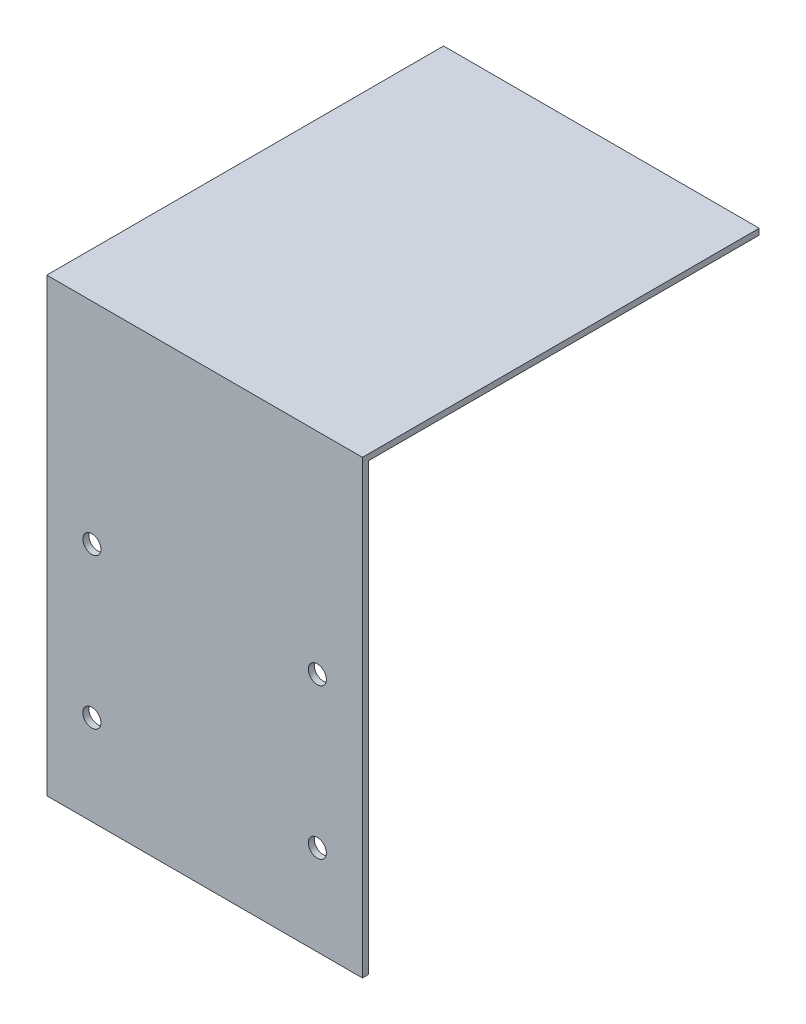
ISO-10303-21;
HEADER;
FILE_DESCRIPTION(('STEP AP214'),'2;1');
FILE_NAME('part.step','',(''),(''),'','','');
FILE_SCHEMA(('AUTOMOTIVE_DESIGN { 1 0 10303 214 1 1 1 1 }'));
ENDSEC;
DATA;
#1=APPLICATION_CONTEXT('core data for automotive mechanical design processes');
#2=APPLICATION_PROTOCOL_DEFINITION('international standard','automotive_design',2000,#1);
#3=PRODUCT_CONTEXT('',#1,'mechanical');
#4=PRODUCT('Part','Part','',(#3));
#5=PRODUCT_RELATED_PRODUCT_CATEGORY('part','',(#4));
#6=PRODUCT_DEFINITION_FORMATION('','',#4);
#7=PRODUCT_DEFINITION_CONTEXT('part definition',#1,'design');
#8=PRODUCT_DEFINITION('design','',#6,#7);
#9=PRODUCT_DEFINITION_SHAPE('','',#8);
#10=(LENGTH_UNIT() NAMED_UNIT(*) SI_UNIT(.MILLI.,.METRE.));
#11=(NAMED_UNIT(*) PLANE_ANGLE_UNIT() SI_UNIT($,.RADIAN.));
#12=(NAMED_UNIT(*) SI_UNIT($,.STERADIAN.) SOLID_ANGLE_UNIT());
#13=UNCERTAINTY_MEASURE_WITH_UNIT(LENGTH_MEASURE(1.E-05),#10,'distance_accuracy_value','');
#14=(GEOMETRIC_REPRESENTATION_CONTEXT(3) GLOBAL_UNCERTAINTY_ASSIGNED_CONTEXT((#13)) GLOBAL_UNIT_ASSIGNED_CONTEXT((#10,
#11,#12)) REPRESENTATION_CONTEXT('',''));
#15=CARTESIAN_POINT('',(0.,0.,0.));
#16=DIRECTION('',(0.,0.,1.));
#17=DIRECTION('',(1.,0.,0.));
#18=AXIS2_PLACEMENT_3D('',#15,#16,#17);
#19=CARTESIAN_POINT('',(105.,150.,2.));
#20=DIRECTION('',(0.,-1.,0.));
#21=DIRECTION('',(0.,0.,-1.));
#22=AXIS2_PLACEMENT_3D('',#19,#20,#21);
#23=PLANE('',#22);
#24=DIRECTION('',(0.,0.,-1.));
#25=VECTOR('',#24,1.);
#26=CARTESIAN_POINT('',(105.,150.,2.));
#27=LINE('',#26,#25);
#28=CARTESIAN_POINT('',(105.,150.,2.));
#29=VERTEX_POINT('',#28);
#30=CARTESIAN_POINT('',(105.,150.,-130.));
#31=VERTEX_POINT('',#30);
#32=EDGE_CURVE('E165',#29,#31,#27,.T.);
#33=ORIENTED_EDGE('',*,*,#32,.T.);
#34=DIRECTION('',(1.,0.,0.));
#35=VECTOR('',#34,1.);
#36=CARTESIAN_POINT('',(105.,150.,-130.));
#37=LINE('',#36,#35);
#38=CARTESIAN_POINT('',(0.,150.,-130.));
#39=VERTEX_POINT('',#38);
#40=EDGE_CURVE('E112',#39,#31,#37,.T.);
#41=ORIENTED_EDGE('',*,*,#40,.F.);
#42=DIRECTION('',(0.,0.,-1.));
#43=VECTOR('',#42,1.);
#44=CARTESIAN_POINT('',(0.,150.,2.));
#45=LINE('',#44,#43);
#46=CARTESIAN_POINT('',(0.,150.,2.));
#47=VERTEX_POINT('',#46);
#48=EDGE_CURVE('E11',#47,#39,#45,.T.);
#49=ORIENTED_EDGE('',*,*,#48,.F.);
#50=DIRECTION('',(-1.,0.,0.));
#51=VECTOR('',#50,1.);
#52=CARTESIAN_POINT('',(105.,150.,2.));
#53=LINE('',#52,#51);
#54=EDGE_CURVE('E77',#29,#47,#53,.T.);
#55=ORIENTED_EDGE('',*,*,#54,.F.);
#56=EDGE_LOOP('',(#33,#41,#49,#55));
#57=FACE_BOUND('',#56,.T.);
#58=ADVANCED_FACE('F32',(#57),#23,.F.);
#59=CARTESIAN_POINT('',(0.,0.,2.));
#60=DIRECTION('',(-1.,0.,0.));
#61=DIRECTION('',(0.,0.,1.));
#62=AXIS2_PLACEMENT_3D('',#59,#60,#61);
#63=PLANE('',#62);
#64=DIRECTION('',(0.,1.,0.));
#65=VECTOR('',#64,1.);
#66=CARTESIAN_POINT('',(0.,0.,0.));
#67=LINE('',#66,#65);
#68=CARTESIAN_POINT('',(0.,0.,0.));
#69=VERTEX_POINT('',#68);
#70=CARTESIAN_POINT('',(0.,148.,0.));
#71=VERTEX_POINT('',#70);
#72=EDGE_CURVE('E117',#69,#71,#67,.T.);
#73=ORIENTED_EDGE('',*,*,#72,.F.);
#74=DIRECTION('',(0.,0.,-1.));
#75=VECTOR('',#74,1.);
#76=CARTESIAN_POINT('',(0.,0.,2.));
#77=LINE('',#76,#75);
#78=CARTESIAN_POINT('',(0.,0.,2.));
#79=VERTEX_POINT('',#78);
#80=EDGE_CURVE('E40',#79,#69,#77,.T.);
#81=ORIENTED_EDGE('',*,*,#80,.F.);
#82=DIRECTION('',(0.,1.,0.));
#83=VECTOR('',#82,1.);
#84=CARTESIAN_POINT('',(0.,0.,2.));
#85=LINE('',#84,#83);
#86=EDGE_CURVE('E178',#79,#47,#85,.T.);
#87=ORIENTED_EDGE('',*,*,#86,.T.);
#88=ORIENTED_EDGE('',*,*,#48,.T.);
#89=DIRECTION('',(0.,1.,0.));
#90=VECTOR('',#89,1.);
#91=CARTESIAN_POINT('',(0.,150.,-130.));
#92=LINE('',#91,#90);
#93=CARTESIAN_POINT('',(0.,148.,-130.));
#94=VERTEX_POINT('',#93);
#95=EDGE_CURVE('E105',#94,#39,#92,.T.);
#96=ORIENTED_EDGE('',*,*,#95,.F.);
#97=DIRECTION('',(0.,0.,1.));
#98=VECTOR('',#97,1.);
#99=CARTESIAN_POINT('',(0.,148.,-130.));
#100=LINE('',#99,#98);
#101=EDGE_CURVE('E101',#94,#71,#100,.T.);
#102=ORIENTED_EDGE('',*,*,#101,.T.);
#103=EDGE_LOOP('',(#73,#81,#87,#88,#96,#102));
#104=FACE_BOUND('',#103,.T.);
#105=ADVANCED_FACE('F176',(#104),#63,.T.);
#106=CARTESIAN_POINT('',(0.,0.,2.));
#107=DIRECTION('',(0.,1.,0.));
#108=DIRECTION('',(0.,0.,1.));
#109=AXIS2_PLACEMENT_3D('',#106,#107,#108);
#110=PLANE('',#109);
#111=DIRECTION('',(1.,0.,0.));
#112=VECTOR('',#111,1.);
#113=CARTESIAN_POINT('',(0.,0.,0.));
#114=LINE('',#113,#112);
#115=CARTESIAN_POINT('',(105.,0.,0.));
#116=VERTEX_POINT('',#115);
#117=EDGE_CURVE('E72',#69,#116,#114,.T.);
#118=ORIENTED_EDGE('',*,*,#117,.T.);
#119=DIRECTION('',(0.,0.,-1.));
#120=VECTOR('',#119,1.);
#121=CARTESIAN_POINT('',(105.,0.,2.));
#122=LINE('',#121,#120);
#123=CARTESIAN_POINT('',(105.,0.,2.));
#124=VERTEX_POINT('',#123);
#125=EDGE_CURVE('E167',#124,#116,#122,.T.);
#126=ORIENTED_EDGE('',*,*,#125,.F.);
#127=DIRECTION('',(1.,0.,0.));
#128=VECTOR('',#127,1.);
#129=CARTESIAN_POINT('',(0.,0.,2.));
#130=LINE('',#129,#128);
#131=EDGE_CURVE('E171',#79,#124,#130,.T.);
#132=ORIENTED_EDGE('',*,*,#131,.F.);
#133=ORIENTED_EDGE('',*,*,#80,.T.);
#134=EDGE_LOOP('',(#118,#126,#132,#133));
#135=FACE_BOUND('',#134,.T.);
#136=ADVANCED_FACE('F170',(#135),#110,.F.);
#137=CARTESIAN_POINT('',(105.,0.,2.));
#138=DIRECTION('',(-1.,0.,0.));
#139=DIRECTION('',(0.,0.,1.));
#140=AXIS2_PLACEMENT_3D('',#137,#138,#139);
#141=PLANE('',#140);
#142=DIRECTION('',(0.,1.,0.));
#143=VECTOR('',#142,1.);
#144=CARTESIAN_POINT('',(105.,0.,0.));
#145=LINE('',#144,#143);
#146=CARTESIAN_POINT('',(105.,148.,0.));
#147=VERTEX_POINT('',#146);
#148=EDGE_CURVE('E116',#116,#147,#145,.T.);
#149=ORIENTED_EDGE('',*,*,#148,.T.);
#150=DIRECTION('',(0.,0.,1.));
#151=VECTOR('',#150,1.);
#152=CARTESIAN_POINT('',(105.,148.,-130.));
#153=LINE('',#152,#151);
#154=CARTESIAN_POINT('',(105.,148.,-130.));
#155=VERTEX_POINT('',#154);
#156=EDGE_CURVE('E99',#155,#147,#153,.T.);
#157=ORIENTED_EDGE('',*,*,#156,.F.);
#158=DIRECTION('',(0.,-1.,0.));
#159=VECTOR('',#158,1.);
#160=CARTESIAN_POINT('',(105.,148.,-130.));
#161=LINE('',#160,#159);
#162=EDGE_CURVE('E106',#31,#155,#161,.T.);
#163=ORIENTED_EDGE('',*,*,#162,.F.);
#164=ORIENTED_EDGE('',*,*,#32,.F.);
#165=DIRECTION('',(0.,1.,0.));
#166=VECTOR('',#165,1.);
#167=CARTESIAN_POINT('',(105.,0.,2.));
#168=LINE('',#167,#166);
#169=EDGE_CURVE('E57',#124,#29,#168,.T.);
#170=ORIENTED_EDGE('',*,*,#169,.F.);
#171=ORIENTED_EDGE('',*,*,#125,.T.);
#172=EDGE_LOOP('',(#149,#157,#163,#164,#170,#171));
#173=FACE_BOUND('',#172,.T.);
#174=ADVANCED_FACE('F115',(#173),#141,.F.);
#175=CARTESIAN_POINT('',(0.,0.,2.));
#176=DIRECTION('',(0.,0.,-1.));
#177=DIRECTION('',(-1.,0.,0.));
#178=AXIS2_PLACEMENT_3D('',#175,#176,#177);
#179=PLANE('',#178);
#180=CARTESIAN_POINT('',(90.,80.,2.));
#181=DIRECTION('',(0.,0.,1.));
#182=DIRECTION('',(1.,0.,0.));
#183=AXIS2_PLACEMENT_3D('',#180,#181,#182);
#184=CIRCLE('',#183,3.00000000000001);
#185=CARTESIAN_POINT('',(93.,80.,2.));
#186=VERTEX_POINT('',#185);
#187=EDGE_CURVE('E145',#186,#186,#184,.T.);
#188=ORIENTED_EDGE('',*,*,#187,.F.);
#189=EDGE_LOOP('',(#188));
#190=FACE_BOUND('',#189,.T.);
#191=CARTESIAN_POINT('',(15.,80.,2.));
#192=DIRECTION('',(0.,0.,1.));
#193=DIRECTION('',(1.,0.,0.));
#194=AXIS2_PLACEMENT_3D('',#191,#192,#193);
#195=CIRCLE('',#194,3.);
#196=CARTESIAN_POINT('',(18.,80.,2.));
#197=VERTEX_POINT('',#196);
#198=EDGE_CURVE('E135',#197,#197,#195,.T.);
#199=ORIENTED_EDGE('',*,*,#198,.F.);
#200=EDGE_LOOP('',(#199));
#201=FACE_BOUND('',#200,.T.);
#202=CARTESIAN_POINT('',(90.,30.,2.));
#203=DIRECTION('',(0.,0.,1.));
#204=DIRECTION('',(1.,0.,0.));
#205=AXIS2_PLACEMENT_3D('',#202,#203,#204);
#206=CIRCLE('',#205,3.00000000000001);
#207=CARTESIAN_POINT('',(93.,30.,2.));
#208=VERTEX_POINT('',#207);
#209=EDGE_CURVE('E132',#208,#208,#206,.T.);
#210=ORIENTED_EDGE('',*,*,#209,.F.);
#211=EDGE_LOOP('',(#210));
#212=FACE_BOUND('',#211,.T.);
#213=CARTESIAN_POINT('',(15.,30.,2.));
#214=DIRECTION('',(0.,0.,1.));
#215=DIRECTION('',(1.,0.,0.));
#216=AXIS2_PLACEMENT_3D('',#213,#214,#215);
#217=CIRCLE('',#216,3.);
#218=CARTESIAN_POINT('',(18.,30.,2.));
#219=VERTEX_POINT('',#218);
#220=EDGE_CURVE('E129',#219,#219,#217,.T.);
#221=ORIENTED_EDGE('',*,*,#220,.F.);
#222=EDGE_LOOP('',(#221));
#223=FACE_BOUND('',#222,.T.);
#224=ORIENTED_EDGE('',*,*,#54,.T.);
#225=ORIENTED_EDGE('',*,*,#86,.F.);
#226=ORIENTED_EDGE('',*,*,#131,.T.);
#227=ORIENTED_EDGE('',*,*,#169,.T.);
#228=EDGE_LOOP('',(#224,#225,#226,#227));
#229=FACE_BOUND('',#228,.T.);
#230=ADVANCED_FACE('F179',(#190,#201,#212,#223,#229),#179,.F.);
#231=CARTESIAN_POINT('',(0.,0.,0.));
#232=DIRECTION('',(0.,0.,-1.));
#233=DIRECTION('',(-1.,0.,0.));
#234=AXIS2_PLACEMENT_3D('',#231,#232,#233);
#235=PLANE('',#234);
#236=CARTESIAN_POINT('',(90.,80.,0.));
#237=DIRECTION('',(0.,0.,-1.));
#238=DIRECTION('',(-1.,0.,0.));
#239=AXIS2_PLACEMENT_3D('',#236,#237,#238);
#240=CIRCLE('',#239,3.00000000000001);
#241=CARTESIAN_POINT('',(87.,80.,0.));
#242=VERTEX_POINT('',#241);
#243=EDGE_CURVE('E35',#242,#242,#240,.T.);
#244=ORIENTED_EDGE('',*,*,#243,.F.);
#245=EDGE_LOOP('',(#244));
#246=FACE_BOUND('',#245,.T.);
#247=CARTESIAN_POINT('',(15.,80.,0.));
#248=DIRECTION('',(0.,0.,-1.));
#249=DIRECTION('',(-1.,0.,0.));
#250=AXIS2_PLACEMENT_3D('',#247,#248,#249);
#251=CIRCLE('',#250,3.);
#252=CARTESIAN_POINT('',(12.,80.,0.));
#253=VERTEX_POINT('',#252);
#254=EDGE_CURVE('E133',#253,#253,#251,.T.);
#255=ORIENTED_EDGE('',*,*,#254,.F.);
#256=EDGE_LOOP('',(#255));
#257=FACE_BOUND('',#256,.T.);
#258=CARTESIAN_POINT('',(90.,30.,0.));
#259=DIRECTION('',(0.,0.,-1.));
#260=DIRECTION('',(-1.,0.,0.));
#261=AXIS2_PLACEMENT_3D('',#258,#259,#260);
#262=CIRCLE('',#261,3.00000000000001);
#263=CARTESIAN_POINT('',(87.,30.,0.));
#264=VERTEX_POINT('',#263);
#265=EDGE_CURVE('E130',#264,#264,#262,.T.);
#266=ORIENTED_EDGE('',*,*,#265,.F.);
#267=EDGE_LOOP('',(#266));
#268=FACE_BOUND('',#267,.T.);
#269=CARTESIAN_POINT('',(15.,30.,0.));
#270=DIRECTION('',(0.,0.,-1.));
#271=DIRECTION('',(-1.,0.,0.));
#272=AXIS2_PLACEMENT_3D('',#269,#270,#271);
#273=CIRCLE('',#272,3.);
#274=CARTESIAN_POINT('',(12.,30.,0.));
#275=VERTEX_POINT('',#274);
#276=EDGE_CURVE('E126',#275,#275,#273,.T.);
#277=ORIENTED_EDGE('',*,*,#276,.F.);
#278=EDGE_LOOP('',(#277));
#279=FACE_BOUND('',#278,.T.);
#280=DIRECTION('',(-1.,0.,0.));
#281=VECTOR('',#280,1.);
#282=CARTESIAN_POINT('',(0.,148.,0.));
#283=LINE('',#282,#281);
#284=EDGE_CURVE('E48',#147,#71,#283,.T.);
#285=ORIENTED_EDGE('',*,*,#284,.F.);
#286=ORIENTED_EDGE('',*,*,#148,.F.);
#287=ORIENTED_EDGE('',*,*,#117,.F.);
#288=ORIENTED_EDGE('',*,*,#72,.T.);
#289=EDGE_LOOP('',(#285,#286,#287,#288));
#290=FACE_BOUND('',#289,.T.);
#291=ADVANCED_FACE('F175',(#246,#257,#268,#279,#290),#235,.T.);
#292=CARTESIAN_POINT('',(0.,148.,-130.));
#293=DIRECTION('',(0.,1.,0.));
#294=DIRECTION('',(0.,0.,1.));
#295=AXIS2_PLACEMENT_3D('',#292,#293,#294);
#296=PLANE('',#295);
#297=ORIENTED_EDGE('',*,*,#284,.T.);
#298=ORIENTED_EDGE('',*,*,#101,.F.);
#299=DIRECTION('',(-1.,0.,0.));
#300=VECTOR('',#299,1.);
#301=CARTESIAN_POINT('',(0.,148.,-130.));
#302=LINE('',#301,#300);
#303=EDGE_CURVE('E95',#155,#94,#302,.T.);
#304=ORIENTED_EDGE('',*,*,#303,.F.);
#305=ORIENTED_EDGE('',*,*,#156,.T.);
#306=EDGE_LOOP('',(#297,#298,#304,#305));
#307=FACE_BOUND('',#306,.T.);
#308=ADVANCED_FACE('F97',(#307),#296,.F.);
#309=CARTESIAN_POINT('',(0.,0.,-130.));
#310=DIRECTION('',(0.,0.,1.));
#311=DIRECTION('',(1.,0.,0.));
#312=AXIS2_PLACEMENT_3D('',#309,#310,#311);
#313=PLANE('',#312);
#314=ORIENTED_EDGE('',*,*,#162,.T.);
#315=ORIENTED_EDGE('',*,*,#303,.T.);
#316=ORIENTED_EDGE('',*,*,#95,.T.);
#317=ORIENTED_EDGE('',*,*,#40,.T.);
#318=EDGE_LOOP('',(#314,#315,#316,#317));
#319=FACE_BOUND('',#318,.T.);
#320=ADVANCED_FACE('F110',(#319),#313,.F.);
#321=CARTESIAN_POINT('',(15.,30.,-8.));
#322=DIRECTION('',(0.,0.,1.));
#323=DIRECTION('',(1.,0.,0.));
#324=AXIS2_PLACEMENT_3D('',#321,#322,#323);
#325=CYLINDRICAL_SURFACE('',#324,3.);
#326=ORIENTED_EDGE('',*,*,#276,.T.);
#327=EDGE_LOOP('',(#326));
#328=FACE_BOUND('',#327,.T.);
#329=ORIENTED_EDGE('',*,*,#220,.T.);
#330=EDGE_LOOP('',(#329));
#331=FACE_BOUND('',#330,.T.);
#332=ADVANCED_FACE('F226',(#328,#331),#325,.F.);
#333=CARTESIAN_POINT('',(90.,30.,-8.));
#334=DIRECTION('',(0.,0.,1.));
#335=DIRECTION('',(1.,0.,0.));
#336=AXIS2_PLACEMENT_3D('',#333,#334,#335);
#337=CYLINDRICAL_SURFACE('',#336,3.00000000000001);
#338=ORIENTED_EDGE('',*,*,#265,.T.);
#339=EDGE_LOOP('',(#338));
#340=FACE_BOUND('',#339,.T.);
#341=ORIENTED_EDGE('',*,*,#209,.T.);
#342=EDGE_LOOP('',(#341));
#343=FACE_BOUND('',#342,.T.);
#344=ADVANCED_FACE('F235',(#340,#343),#337,.F.);
#345=CARTESIAN_POINT('',(15.,80.,-8.));
#346=DIRECTION('',(0.,0.,1.));
#347=DIRECTION('',(1.,0.,0.));
#348=AXIS2_PLACEMENT_3D('',#345,#346,#347);
#349=CYLINDRICAL_SURFACE('',#348,3.);
#350=ORIENTED_EDGE('',*,*,#254,.T.);
#351=EDGE_LOOP('',(#350));
#352=FACE_BOUND('',#351,.T.);
#353=ORIENTED_EDGE('',*,*,#198,.T.);
#354=EDGE_LOOP('',(#353));
#355=FACE_BOUND('',#354,.T.);
#356=ADVANCED_FACE('F245',(#352,#355),#349,.F.);
#357=CARTESIAN_POINT('',(90.,80.,-8.));
#358=DIRECTION('',(0.,0.,1.));
#359=DIRECTION('',(1.,0.,0.));
#360=AXIS2_PLACEMENT_3D('',#357,#358,#359);
#361=CYLINDRICAL_SURFACE('',#360,3.00000000000001);
#362=ORIENTED_EDGE('',*,*,#243,.T.);
#363=EDGE_LOOP('',(#362));
#364=FACE_BOUND('',#363,.T.);
#365=ORIENTED_EDGE('',*,*,#187,.T.);
#366=EDGE_LOOP('',(#365));
#367=FACE_BOUND('',#366,.T.);
#368=ADVANCED_FACE('F254',(#364,#367),#361,.F.);
#369=CLOSED_SHELL('',(#58,#105,#136,#174,#230,#291,#308,#320,#332,#344,#356,#368));
#370=MANIFOLD_SOLID_BREP('B2',#369);
#371=ADVANCED_BREP_SHAPE_REPRESENTATION('',(#18,#370),#14);
#372=SHAPE_DEFINITION_REPRESENTATION(#9,#371);
ENDSEC;
END-ISO-10303-21;
